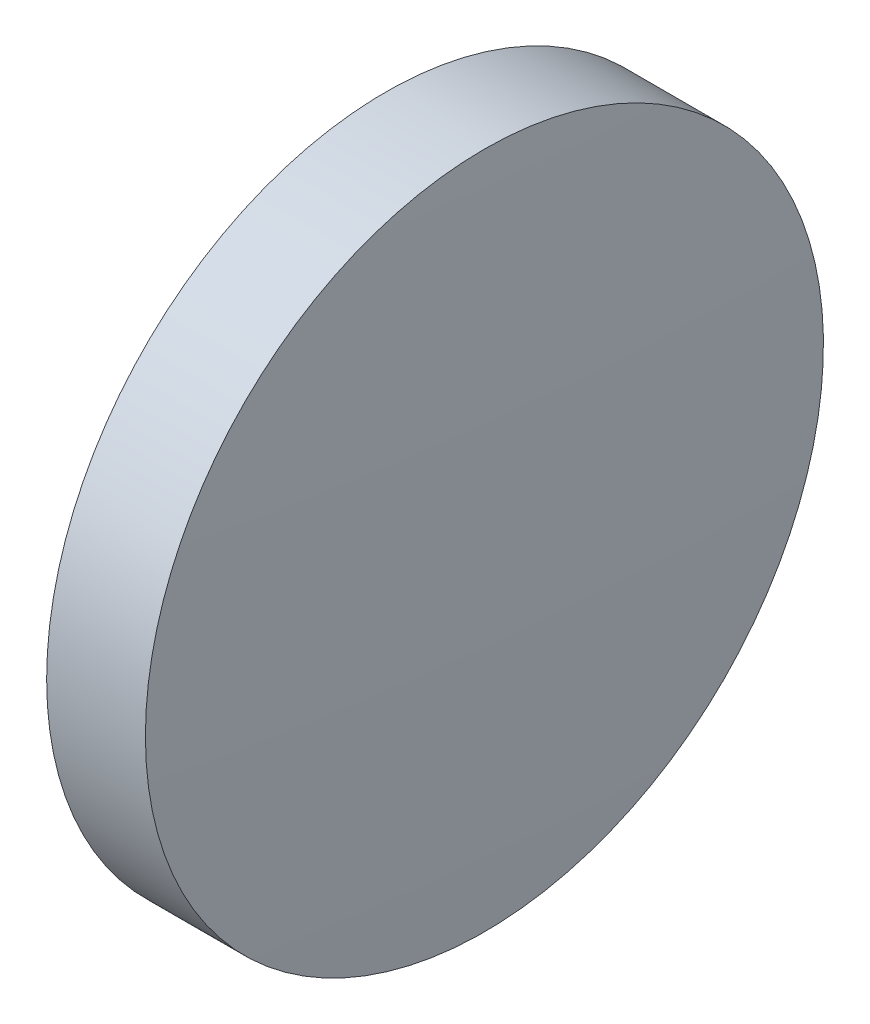
ISO-10303-21;
HEADER;
FILE_DESCRIPTION(('STEP AP214'),'2;1');
FILE_NAME('part.step','',(''),(''),'','','');
FILE_SCHEMA(('AUTOMOTIVE_DESIGN { 1 0 10303 214 1 1 1 1 }'));
ENDSEC;
DATA;
#1=APPLICATION_CONTEXT('core data for automotive mechanical design processes');
#2=APPLICATION_PROTOCOL_DEFINITION('international standard','automotive_design',2000,#1);
#3=PRODUCT_CONTEXT('',#1,'mechanical');
#4=PRODUCT('Part','Part','',(#3));
#5=PRODUCT_RELATED_PRODUCT_CATEGORY('part','',(#4));
#6=PRODUCT_DEFINITION_FORMATION('','',#4);
#7=PRODUCT_DEFINITION_CONTEXT('part definition',#1,'design');
#8=PRODUCT_DEFINITION('design','',#6,#7);
#9=PRODUCT_DEFINITION_SHAPE('','',#8);
#10=(LENGTH_UNIT() NAMED_UNIT(*) SI_UNIT(.MILLI.,.METRE.));
#11=(NAMED_UNIT(*) PLANE_ANGLE_UNIT() SI_UNIT($,.RADIAN.));
#12=(NAMED_UNIT(*) SI_UNIT($,.STERADIAN.) SOLID_ANGLE_UNIT());
#13=UNCERTAINTY_MEASURE_WITH_UNIT(LENGTH_MEASURE(1.E-05),#10,'distance_accuracy_value','');
#14=(GEOMETRIC_REPRESENTATION_CONTEXT(3) GLOBAL_UNCERTAINTY_ASSIGNED_CONTEXT((#13)) GLOBAL_UNIT_ASSIGNED_CONTEXT((#10,
#11,#12)) REPRESENTATION_CONTEXT('',''));
#15=CARTESIAN_POINT('',(0.,0.,0.));
#16=DIRECTION('',(0.,0.,1.));
#17=DIRECTION('',(1.,0.,0.));
#18=AXIS2_PLACEMENT_3D('',#15,#16,#17);
#19=CARTESIAN_POINT('',(-149.202111190468,65.233554926412,0.));
#20=DIRECTION('',(-1.,0.,0.));
#21=DIRECTION('',(0.,1.,0.));
#22=AXIS2_PLACEMENT_3D('',#19,#20,#21);
#23=SPHERICAL_SURFACE('',#22,268.966666666669);
#24=CARTESIAN_POINT('',(119.464555476201,65.2335549264122,0.));
#25=DIRECTION('',(-1.,0.,0.));
#26=DIRECTION('',(0.,0.,1.));
#27=AXIS2_PLACEMENT_3D('',#24,#25,#26);
#28=CIRCLE('',#27,12.7);
#29=CARTESIAN_POINT('',(119.464555476201,65.2335549264122,12.7));
#30=VERTEX_POINT('',#29);
#31=EDGE_CURVE('E10',#30,#30,#28,.T.);
#32=ORIENTED_EDGE('',*,*,#31,.F.);
#33=EDGE_LOOP('',(#32));
#34=FACE_BOUND('',#33,.T.);
#35=ADVANCED_FACE('F35',(#34),#23,.T.);
#36=CARTESIAN_POINT('',(110.165373228488,65.2335549264122,0.));
#37=DIRECTION('',(-1.,0.,0.));
#38=DIRECTION('',(0.,0.,1.));
#39=AXIS2_PLACEMENT_3D('',#36,#37,#38);
#40=CYLINDRICAL_SURFACE('',#39,12.7);
#41=CARTESIAN_POINT('',(115.764555476201,65.2335549264122,0.));
#42=DIRECTION('',(-1.,0.,0.));
#43=DIRECTION('',(0.,0.,1.));
#44=AXIS2_PLACEMENT_3D('',#41,#42,#43);
#45=CIRCLE('',#44,12.7);
#46=CARTESIAN_POINT('',(115.764555476201,65.2335549264122,12.7));
#47=VERTEX_POINT('',#46);
#48=EDGE_CURVE('E41',#47,#47,#45,.T.);
#49=ORIENTED_EDGE('',*,*,#48,.F.);
#50=EDGE_LOOP('',(#49));
#51=FACE_BOUND('',#50,.T.);
#52=ORIENTED_EDGE('',*,*,#31,.T.);
#53=EDGE_LOOP('',(#52));
#54=FACE_BOUND('',#53,.T.);
#55=ADVANCED_FACE('F49',(#51,#54),#40,.T.);
#56=CARTESIAN_POINT('',(115.764555476201,65.2335549264122,0.));
#57=DIRECTION('',(1.,0.,0.));
#58=DIRECTION('',(0.,0.,-1.));
#59=AXIS2_PLACEMENT_3D('',#56,#57,#58);
#60=PLANE('',#59);
#61=ORIENTED_EDGE('',*,*,#48,.T.);
#62=EDGE_LOOP('',(#61));
#63=FACE_BOUND('',#62,.T.);
#64=ADVANCED_FACE('F47',(#63),#60,.F.);
#65=CLOSED_SHELL('',(#35,#55,#64));
#66=MANIFOLD_SOLID_BREP('B2',#65);
#67=ADVANCED_BREP_SHAPE_REPRESENTATION('',(#18,#66),#14);
#68=SHAPE_DEFINITION_REPRESENTATION(#9,#67);
ENDSEC;
END-ISO-10303-21;
